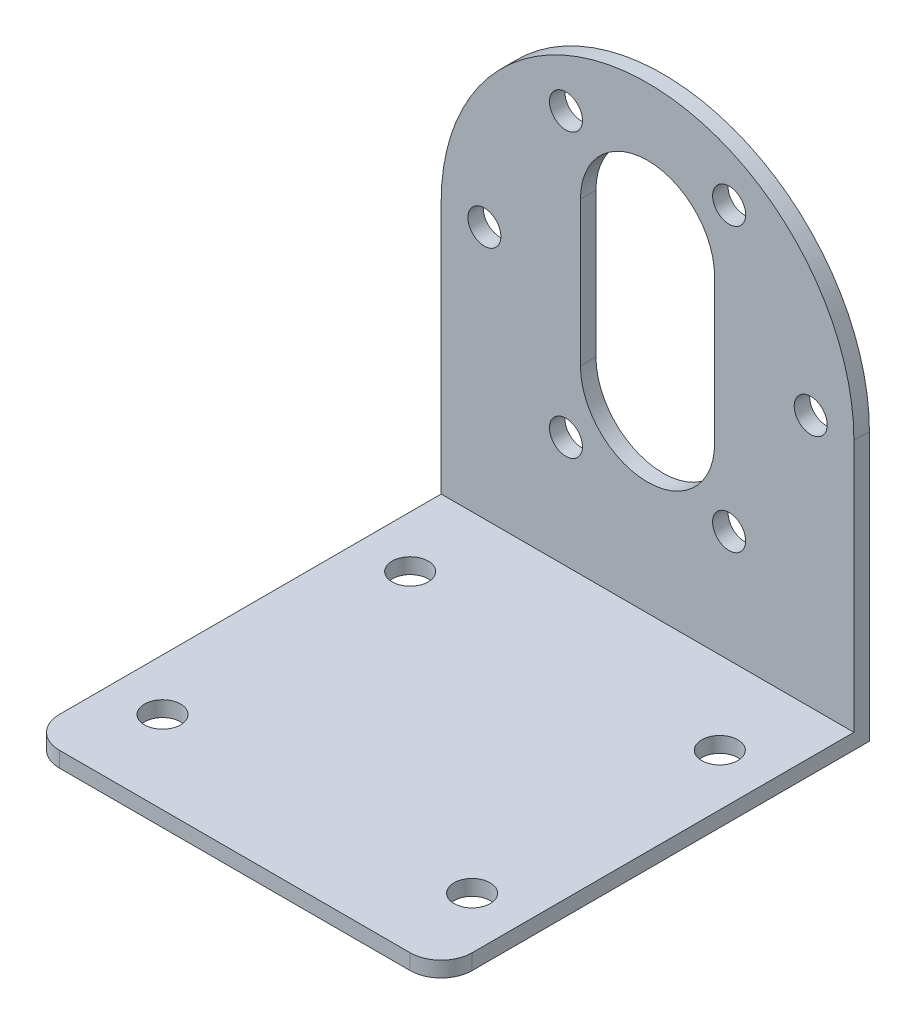
ISO-10303-21;
HEADER;
FILE_DESCRIPTION(('STEP AP214'),'2;1');
FILE_NAME('part.step','',(''),(''),'','','');
FILE_SCHEMA(('AUTOMOTIVE_DESIGN { 1 0 10303 214 1 1 1 1 }'));
ENDSEC;
DATA;
#1=APPLICATION_CONTEXT('core data for automotive mechanical design processes');
#2=APPLICATION_PROTOCOL_DEFINITION('international standard','automotive_design',2000,#1);
#3=PRODUCT_CONTEXT('',#1,'mechanical');
#4=PRODUCT('Part','Part','',(#3));
#5=PRODUCT_RELATED_PRODUCT_CATEGORY('part','',(#4));
#6=PRODUCT_DEFINITION_FORMATION('','',#4);
#7=PRODUCT_DEFINITION_CONTEXT('part definition',#1,'design');
#8=PRODUCT_DEFINITION('design','',#6,#7);
#9=PRODUCT_DEFINITION_SHAPE('','',#8);
#10=(LENGTH_UNIT() NAMED_UNIT(*) SI_UNIT(.MILLI.,.METRE.));
#11=(NAMED_UNIT(*) PLANE_ANGLE_UNIT() SI_UNIT($,.RADIAN.));
#12=(NAMED_UNIT(*) SI_UNIT($,.STERADIAN.) SOLID_ANGLE_UNIT());
#13=UNCERTAINTY_MEASURE_WITH_UNIT(LENGTH_MEASURE(1.E-05),#10,'distance_accuracy_value','');
#14=(GEOMETRIC_REPRESENTATION_CONTEXT(3) GLOBAL_UNCERTAINTY_ASSIGNED_CONTEXT((#13)) GLOBAL_UNIT_ASSIGNED_CONTEXT((#10,
#11,#12)) REPRESENTATION_CONTEXT('',''));
#15=CARTESIAN_POINT('',(0.,0.,0.));
#16=DIRECTION('',(0.,0.,1.));
#17=DIRECTION('',(1.,0.,0.));
#18=AXIS2_PLACEMENT_3D('',#15,#16,#17);
#19=CARTESIAN_POINT('',(0.,1.5,0.));
#20=DIRECTION('',(0.,1.,0.));
#21=DIRECTION('',(0.,0.,1.));
#22=AXIS2_PLACEMENT_3D('',#19,#20,#21);
#23=PLANE('',#22);
#24=CARTESIAN_POINT('',(14.9999999999999,1.5,-12.));
#25=DIRECTION('',(0.,1.,0.));
#26=DIRECTION('',(0.,0.,1.));
#27=AXIS2_PLACEMENT_3D('',#24,#25,#26);
#28=CIRCLE('',#27,1.75);
#29=CARTESIAN_POINT('',(14.9999999999999,1.5,-10.25));
#30=VERTEX_POINT('',#29);
#31=EDGE_CURVE('E207',#30,#30,#28,.T.);
#32=ORIENTED_EDGE('',*,*,#31,.F.);
#33=EDGE_LOOP('',(#32));
#34=FACE_BOUND('',#33,.T.);
#35=CARTESIAN_POINT('',(-15.,1.5,12.));
#36=DIRECTION('',(0.,1.,0.));
#37=DIRECTION('',(0.,0.,1.));
#38=AXIS2_PLACEMENT_3D('',#35,#36,#37);
#39=CIRCLE('',#38,1.75);
#40=CARTESIAN_POINT('',(-15.,1.5,13.75));
#41=VERTEX_POINT('',#40);
#42=EDGE_CURVE('E219',#41,#41,#39,.T.);
#43=ORIENTED_EDGE('',*,*,#42,.F.);
#44=EDGE_LOOP('',(#43));
#45=FACE_BOUND('',#44,.T.);
#46=DIRECTION('',(1.,0.,0.));
#47=VECTOR('',#46,1.);
#48=CARTESIAN_POINT('',(-20.,1.5,20.));
#49=LINE('',#48,#47);
#50=CARTESIAN_POINT('',(-17.,1.5,20.));
#51=VERTEX_POINT('',#50);
#52=CARTESIAN_POINT('',(17.,1.5,20.));
#53=VERTEX_POINT('',#52);
#54=EDGE_CURVE('E227',#51,#53,#49,.T.);
#55=ORIENTED_EDGE('',*,*,#54,.T.);
#56=CARTESIAN_POINT('',(17.,1.5,17.));
#57=DIRECTION('',(0.,1.,0.));
#58=DIRECTION('',(0.,0.,1.));
#59=AXIS2_PLACEMENT_3D('',#56,#57,#58);
#60=CIRCLE('',#59,3.);
#61=CARTESIAN_POINT('',(20.,1.5,17.));
#62=VERTEX_POINT('',#61);
#63=EDGE_CURVE('E49',#53,#62,#60,.T.);
#64=ORIENTED_EDGE('',*,*,#63,.T.);
#65=DIRECTION('',(0.,0.,-1.));
#66=VECTOR('',#65,1.);
#67=CARTESIAN_POINT('',(20.,1.5,-20.));
#68=LINE('',#67,#66);
#69=CARTESIAN_POINT('',(20.,1.5,-20.));
#70=VERTEX_POINT('',#69);
#71=EDGE_CURVE('E230',#62,#70,#68,.T.);
#72=ORIENTED_EDGE('',*,*,#71,.T.);
#73=DIRECTION('',(-1.,0.,0.));
#74=VECTOR('',#73,1.);
#75=CARTESIAN_POINT('',(-20.,1.5,-20.));
#76=LINE('',#75,#74);
#77=CARTESIAN_POINT('',(-20.,1.5,-20.));
#78=VERTEX_POINT('',#77);
#79=EDGE_CURVE('E233',#70,#78,#76,.T.);
#80=ORIENTED_EDGE('',*,*,#79,.T.);
#81=DIRECTION('',(0.,0.,1.));
#82=VECTOR('',#81,1.);
#83=CARTESIAN_POINT('',(-20.,1.5,-20.));
#84=LINE('',#83,#82);
#85=CARTESIAN_POINT('',(-20.,1.5,17.));
#86=VERTEX_POINT('',#85);
#87=EDGE_CURVE('E225',#78,#86,#84,.T.);
#88=ORIENTED_EDGE('',*,*,#87,.T.);
#89=CARTESIAN_POINT('',(-17.,1.5,17.));
#90=DIRECTION('',(0.,1.,0.));
#91=DIRECTION('',(0.,0.,1.));
#92=AXIS2_PLACEMENT_3D('',#89,#90,#91);
#93=CIRCLE('',#92,3.);
#94=EDGE_CURVE('E251',#86,#51,#93,.T.);
#95=ORIENTED_EDGE('',*,*,#94,.T.);
#96=EDGE_LOOP('',(#55,#64,#72,#80,#88,#95));
#97=FACE_BOUND('',#96,.T.);
#98=CARTESIAN_POINT('',(15.,1.5,12.));
#99=DIRECTION('',(0.,1.,0.));
#100=DIRECTION('',(0.,0.,1.));
#101=AXIS2_PLACEMENT_3D('',#98,#99,#100);
#102=CIRCLE('',#101,1.75);
#103=CARTESIAN_POINT('',(15.,1.5,13.75));
#104=VERTEX_POINT('',#103);
#105=EDGE_CURVE('E213',#104,#104,#102,.T.);
#106=ORIENTED_EDGE('',*,*,#105,.F.);
#107=EDGE_LOOP('',(#106));
#108=FACE_BOUND('',#107,.T.);
#109=CARTESIAN_POINT('',(-15.0000000000001,1.5,-12.));
#110=DIRECTION('',(0.,1.,0.));
#111=DIRECTION('',(0.,0.,1.));
#112=AXIS2_PLACEMENT_3D('',#109,#110,#111);
#113=CIRCLE('',#112,1.75);
#114=CARTESIAN_POINT('',(-15.0000000000001,1.5,-10.25));
#115=VERTEX_POINT('',#114);
#116=EDGE_CURVE('E201',#115,#115,#113,.T.);
#117=ORIENTED_EDGE('',*,*,#116,.F.);
#118=EDGE_LOOP('',(#117));
#119=FACE_BOUND('',#118,.T.);
#120=ADVANCED_FACE('F41',(#34,#45,#97,#108,#119),#23,.T.);
#121=CARTESIAN_POINT('',(0.,0.,0.));
#122=DIRECTION('',(0.,1.,0.));
#123=DIRECTION('',(0.,0.,1.));
#124=AXIS2_PLACEMENT_3D('',#121,#122,#123);
#125=PLANE('',#124);
#126=DIRECTION('',(0.,0.,-1.));
#127=VECTOR('',#126,1.);
#128=CARTESIAN_POINT('',(20.,0.,-20.));
#129=LINE('',#128,#127);
#130=CARTESIAN_POINT('',(20.,0.,17.));
#131=VERTEX_POINT('',#130);
#132=CARTESIAN_POINT('',(20.,0.,-21.5));
#133=VERTEX_POINT('',#132);
#134=EDGE_CURVE('E228',#131,#133,#129,.T.);
#135=ORIENTED_EDGE('',*,*,#134,.F.);
#136=CARTESIAN_POINT('',(17.,0.,17.));
#137=DIRECTION('',(0.,1.,0.));
#138=DIRECTION('',(0.,0.,1.));
#139=AXIS2_PLACEMENT_3D('',#136,#137,#138);
#140=CIRCLE('',#139,3.);
#141=CARTESIAN_POINT('',(17.,0.,20.));
#142=VERTEX_POINT('',#141);
#143=EDGE_CURVE('E245',#131,#142,#140,.F.);
#144=ORIENTED_EDGE('',*,*,#143,.T.);
#145=DIRECTION('',(1.,0.,0.));
#146=VECTOR('',#145,1.);
#147=CARTESIAN_POINT('',(-20.,0.,20.));
#148=LINE('',#147,#146);
#149=CARTESIAN_POINT('',(-17.,0.,20.));
#150=VERTEX_POINT('',#149);
#151=EDGE_CURVE('E238',#150,#142,#148,.T.);
#152=ORIENTED_EDGE('',*,*,#151,.F.);
#153=CARTESIAN_POINT('',(-17.,0.,17.));
#154=DIRECTION('',(0.,1.,0.));
#155=DIRECTION('',(0.,0.,1.));
#156=AXIS2_PLACEMENT_3D('',#153,#154,#155);
#157=CIRCLE('',#156,3.);
#158=CARTESIAN_POINT('',(-20.,0.,17.));
#159=VERTEX_POINT('',#158);
#160=EDGE_CURVE('E243',#150,#159,#157,.F.);
#161=ORIENTED_EDGE('',*,*,#160,.T.);
#162=DIRECTION('',(0.,0.,1.));
#163=VECTOR('',#162,1.);
#164=CARTESIAN_POINT('',(-20.,0.,-20.));
#165=LINE('',#164,#163);
#166=CARTESIAN_POINT('',(-20.,0.,-21.5));
#167=VERTEX_POINT('',#166);
#168=EDGE_CURVE('E222',#167,#159,#165,.T.);
#169=ORIENTED_EDGE('',*,*,#168,.F.);
#170=DIRECTION('',(-1.,0.,0.));
#171=VECTOR('',#170,1.);
#172=CARTESIAN_POINT('',(20.,0.,-21.5));
#173=LINE('',#172,#171);
#174=EDGE_CURVE('E181',#133,#167,#173,.T.);
#175=ORIENTED_EDGE('',*,*,#174,.F.);
#176=EDGE_LOOP('',(#135,#144,#152,#161,#169,#175));
#177=FACE_BOUND('',#176,.T.);
#178=CARTESIAN_POINT('',(-15.,0.,12.));
#179=DIRECTION('',(0.,1.,0.));
#180=DIRECTION('',(0.,0.,1.));
#181=AXIS2_PLACEMENT_3D('',#178,#179,#180);
#182=CIRCLE('',#181,1.75);
#183=CARTESIAN_POINT('',(-15.,0.,13.75));
#184=VERTEX_POINT('',#183);
#185=EDGE_CURVE('E216',#184,#184,#182,.T.);
#186=ORIENTED_EDGE('',*,*,#185,.T.);
#187=EDGE_LOOP('',(#186));
#188=FACE_BOUND('',#187,.T.);
#189=CARTESIAN_POINT('',(15.,0.,12.));
#190=DIRECTION('',(0.,1.,0.));
#191=DIRECTION('',(0.,0.,1.));
#192=AXIS2_PLACEMENT_3D('',#189,#190,#191);
#193=CIRCLE('',#192,1.75);
#194=CARTESIAN_POINT('',(15.,0.,13.75));
#195=VERTEX_POINT('',#194);
#196=EDGE_CURVE('E210',#195,#195,#193,.T.);
#197=ORIENTED_EDGE('',*,*,#196,.T.);
#198=EDGE_LOOP('',(#197));
#199=FACE_BOUND('',#198,.T.);
#200=CARTESIAN_POINT('',(14.9999999999999,0.,-12.));
#201=DIRECTION('',(0.,1.,0.));
#202=DIRECTION('',(0.,0.,1.));
#203=AXIS2_PLACEMENT_3D('',#200,#201,#202);
#204=CIRCLE('',#203,1.75);
#205=CARTESIAN_POINT('',(14.9999999999999,0.,-10.25));
#206=VERTEX_POINT('',#205);
#207=EDGE_CURVE('E204',#206,#206,#204,.T.);
#208=ORIENTED_EDGE('',*,*,#207,.T.);
#209=EDGE_LOOP('',(#208));
#210=FACE_BOUND('',#209,.T.);
#211=CARTESIAN_POINT('',(-15.0000000000001,0.,-12.));
#212=DIRECTION('',(0.,1.,0.));
#213=DIRECTION('',(0.,0.,1.));
#214=AXIS2_PLACEMENT_3D('',#211,#212,#213);
#215=CIRCLE('',#214,1.75);
#216=CARTESIAN_POINT('',(-15.0000000000001,0.,-10.25));
#217=VERTEX_POINT('',#216);
#218=EDGE_CURVE('E200',#217,#217,#215,.T.);
#219=ORIENTED_EDGE('',*,*,#218,.T.);
#220=EDGE_LOOP('',(#219));
#221=FACE_BOUND('',#220,.T.);
#222=ADVANCED_FACE('F265',(#177,#188,#199,#210,#221),#125,.F.);
#223=CARTESIAN_POINT('',(-20.,1.5,-20.));
#224=DIRECTION('',(1.,0.,0.));
#225=DIRECTION('',(0.,0.,-1.));
#226=AXIS2_PLACEMENT_3D('',#223,#224,#225);
#227=PLANE('',#226);
#228=ORIENTED_EDGE('',*,*,#168,.T.);
#229=DIRECTION('',(0.,-1.,0.));
#230=VECTOR('',#229,1.);
#231=CARTESIAN_POINT('',(-20.,1.5,17.));
#232=LINE('',#231,#230);
#233=EDGE_CURVE('E11',#159,#86,#232,.F.);
#234=ORIENTED_EDGE('',*,*,#233,.T.);
#235=ORIENTED_EDGE('',*,*,#87,.F.);
#236=DIRECTION('',(0.,1.,0.));
#237=VECTOR('',#236,1.);
#238=CARTESIAN_POINT('',(-20.,0.,-20.));
#239=LINE('',#238,#237);
#240=CARTESIAN_POINT('',(-20.,26.,-20.));
#241=VERTEX_POINT('',#240);
#242=EDGE_CURVE('E192',#78,#241,#239,.T.);
#243=ORIENTED_EDGE('',*,*,#242,.T.);
#244=DIRECTION('',(0.,0.,1.));
#245=VECTOR('',#244,1.);
#246=CARTESIAN_POINT('',(-20.,26.,-21.5));
#247=LINE('',#246,#245);
#248=CARTESIAN_POINT('',(-20.,26.,-21.5));
#249=VERTEX_POINT('',#248);
#250=EDGE_CURVE('E197',#249,#241,#247,.T.);
#251=ORIENTED_EDGE('',*,*,#250,.F.);
#252=DIRECTION('',(0.,1.,0.));
#253=VECTOR('',#252,1.);
#254=CARTESIAN_POINT('',(-20.,0.,-21.5));
#255=LINE('',#254,#253);
#256=EDGE_CURVE('E185',#167,#249,#255,.T.);
#257=ORIENTED_EDGE('',*,*,#256,.F.);
#258=EDGE_LOOP('',(#228,#234,#235,#243,#251,#257));
#259=FACE_BOUND('',#258,.T.);
#260=ADVANCED_FACE('F273',(#259),#227,.F.);
#261=CARTESIAN_POINT('',(-20.,1.5,20.));
#262=DIRECTION('',(0.,0.,-1.));
#263=DIRECTION('',(-1.,0.,0.));
#264=AXIS2_PLACEMENT_3D('',#261,#262,#263);
#265=PLANE('',#264);
#266=ORIENTED_EDGE('',*,*,#151,.T.);
#267=DIRECTION('',(0.,-1.,0.));
#268=VECTOR('',#267,1.);
#269=CARTESIAN_POINT('',(17.,1.5,20.));
#270=LINE('',#269,#268);
#271=EDGE_CURVE('E62',#142,#53,#270,.F.);
#272=ORIENTED_EDGE('',*,*,#271,.T.);
#273=ORIENTED_EDGE('',*,*,#54,.F.);
#274=DIRECTION('',(0.,-1.,0.));
#275=VECTOR('',#274,1.);
#276=CARTESIAN_POINT('',(-17.,1.5,20.));
#277=LINE('',#276,#275);
#278=EDGE_CURVE('E247',#51,#150,#277,.T.);
#279=ORIENTED_EDGE('',*,*,#278,.T.);
#280=EDGE_LOOP('',(#266,#272,#273,#279));
#281=FACE_BOUND('',#280,.T.);
#282=ADVANCED_FACE('F268',(#281),#265,.F.);
#283=CARTESIAN_POINT('',(20.,1.5,-20.));
#284=DIRECTION('',(-1.,0.,0.));
#285=DIRECTION('',(0.,0.,1.));
#286=AXIS2_PLACEMENT_3D('',#283,#284,#285);
#287=PLANE('',#286);
#288=ORIENTED_EDGE('',*,*,#71,.F.);
#289=DIRECTION('',(0.,-1.,0.));
#290=VECTOR('',#289,1.);
#291=CARTESIAN_POINT('',(20.,1.5,17.));
#292=LINE('',#291,#290);
#293=EDGE_CURVE('E236',#62,#131,#292,.T.);
#294=ORIENTED_EDGE('',*,*,#293,.T.);
#295=ORIENTED_EDGE('',*,*,#134,.T.);
#296=DIRECTION('',(0.,-1.,0.));
#297=VECTOR('',#296,1.);
#298=CARTESIAN_POINT('',(20.,0.,-21.5));
#299=LINE('',#298,#297);
#300=CARTESIAN_POINT('',(20.,26.,-21.5));
#301=VERTEX_POINT('',#300);
#302=EDGE_CURVE('E178',#301,#133,#299,.T.);
#303=ORIENTED_EDGE('',*,*,#302,.F.);
#304=DIRECTION('',(0.,0.,1.));
#305=VECTOR('',#304,1.);
#306=CARTESIAN_POINT('',(20.,26.,-21.5));
#307=LINE('',#306,#305);
#308=CARTESIAN_POINT('',(20.,26.,-20.));
#309=VERTEX_POINT('',#308);
#310=EDGE_CURVE('E189',#301,#309,#307,.T.);
#311=ORIENTED_EDGE('',*,*,#310,.T.);
#312=DIRECTION('',(0.,-1.,0.));
#313=VECTOR('',#312,1.);
#314=CARTESIAN_POINT('',(20.,0.,-20.));
#315=LINE('',#314,#313);
#316=EDGE_CURVE('E151',#309,#70,#315,.T.);
#317=ORIENTED_EDGE('',*,*,#316,.T.);
#318=EDGE_LOOP('',(#288,#294,#295,#303,#311,#317));
#319=FACE_BOUND('',#318,.T.);
#320=ADVANCED_FACE('F259',(#319),#287,.F.);
#321=CARTESIAN_POINT('',(-15.,1.5,12.));
#322=DIRECTION('',(0.,-1.,0.));
#323=DIRECTION('',(0.,0.,-1.));
#324=AXIS2_PLACEMENT_3D('',#321,#322,#323);
#325=CYLINDRICAL_SURFACE('',#324,1.75);
#326=ORIENTED_EDGE('',*,*,#42,.T.);
#327=EDGE_LOOP('',(#326));
#328=FACE_BOUND('',#327,.T.);
#329=ORIENTED_EDGE('',*,*,#185,.F.);
#330=EDGE_LOOP('',(#329));
#331=FACE_BOUND('',#330,.T.);
#332=ADVANCED_FACE('F304',(#328,#331),#325,.F.);
#333=CARTESIAN_POINT('',(15.,1.5,12.));
#334=DIRECTION('',(0.,-1.,0.));
#335=DIRECTION('',(0.,0.,-1.));
#336=AXIS2_PLACEMENT_3D('',#333,#334,#335);
#337=CYLINDRICAL_SURFACE('',#336,1.75);
#338=ORIENTED_EDGE('',*,*,#105,.T.);
#339=EDGE_LOOP('',(#338));
#340=FACE_BOUND('',#339,.T.);
#341=ORIENTED_EDGE('',*,*,#196,.F.);
#342=EDGE_LOOP('',(#341));
#343=FACE_BOUND('',#342,.T.);
#344=ADVANCED_FACE('F323',(#340,#343),#337,.F.);
#345=CARTESIAN_POINT('',(14.9999999999999,1.5,-12.));
#346=DIRECTION('',(0.,-1.,0.));
#347=DIRECTION('',(0.,0.,-1.));
#348=AXIS2_PLACEMENT_3D('',#345,#346,#347);
#349=CYLINDRICAL_SURFACE('',#348,1.75);
#350=ORIENTED_EDGE('',*,*,#31,.T.);
#351=EDGE_LOOP('',(#350));
#352=FACE_BOUND('',#351,.T.);
#353=ORIENTED_EDGE('',*,*,#207,.F.);
#354=EDGE_LOOP('',(#353));
#355=FACE_BOUND('',#354,.T.);
#356=ADVANCED_FACE('F318',(#352,#355),#349,.F.);
#357=CARTESIAN_POINT('',(-15.0000000000001,1.5,-12.));
#358=DIRECTION('',(0.,-1.,0.));
#359=DIRECTION('',(0.,0.,-1.));
#360=AXIS2_PLACEMENT_3D('',#357,#358,#359);
#361=CYLINDRICAL_SURFACE('',#360,1.75);
#362=ORIENTED_EDGE('',*,*,#116,.T.);
#363=EDGE_LOOP('',(#362));
#364=FACE_BOUND('',#363,.T.);
#365=ORIENTED_EDGE('',*,*,#218,.F.);
#366=EDGE_LOOP('',(#365));
#367=FACE_BOUND('',#366,.T.);
#368=ADVANCED_FACE('F313',(#364,#367),#361,.F.);
#369=CARTESIAN_POINT('',(17.,1.5,17.));
#370=DIRECTION('',(0.,-1.,0.));
#371=DIRECTION('',(0.,0.,-1.));
#372=AXIS2_PLACEMENT_3D('',#369,#370,#371);
#373=CYLINDRICAL_SURFACE('',#372,3.);
#374=ORIENTED_EDGE('',*,*,#63,.F.);
#375=ORIENTED_EDGE('',*,*,#271,.F.);
#376=ORIENTED_EDGE('',*,*,#143,.F.);
#377=ORIENTED_EDGE('',*,*,#293,.F.);
#378=EDGE_LOOP('',(#374,#375,#376,#377));
#379=FACE_BOUND('',#378,.T.);
#380=ADVANCED_FACE('F262',(#379),#373,.T.);
#381=CARTESIAN_POINT('',(-17.,1.5,17.));
#382=DIRECTION('',(0.,-1.,0.));
#383=DIRECTION('',(0.,0.,-1.));
#384=AXIS2_PLACEMENT_3D('',#381,#382,#383);
#385=CYLINDRICAL_SURFACE('',#384,3.);
#386=ORIENTED_EDGE('',*,*,#94,.F.);
#387=ORIENTED_EDGE('',*,*,#233,.F.);
#388=ORIENTED_EDGE('',*,*,#160,.F.);
#389=ORIENTED_EDGE('',*,*,#278,.F.);
#390=EDGE_LOOP('',(#386,#387,#388,#389));
#391=FACE_BOUND('',#390,.T.);
#392=ADVANCED_FACE('F43',(#391),#385,.T.);
#393=CARTESIAN_POINT('',(0.,26.,-21.5));
#394=DIRECTION('',(0.,0.,-1.));
#395=DIRECTION('',(-1.,0.,0.));
#396=AXIS2_PLACEMENT_3D('',#393,#394,#395);
#397=PLANE('',#396);
#398=CARTESIAN_POINT('',(7.90585582992862,39.6933439747513,-21.5));
#399=DIRECTION('',(0.,0.,-1.));
#400=DIRECTION('',(-1.,0.,0.));
#401=AXIS2_PLACEMENT_3D('',#398,#399,#400);
#402=CIRCLE('',#401,1.6);
#403=CARTESIAN_POINT('',(6.30585582992862,39.6933439747513,-21.5));
#404=VERTEX_POINT('',#403);
#405=EDGE_CURVE('E536',#404,#404,#402,.T.);
#406=ORIENTED_EDGE('',*,*,#405,.F.);
#407=EDGE_LOOP('',(#406));
#408=FACE_BOUND('',#407,.T.);
#409=CARTESIAN_POINT('',(7.90585582992881,12.3066560252488,-21.5));
#410=DIRECTION('',(0.,0.,-1.));
#411=DIRECTION('',(-1.,0.,0.));
#412=AXIS2_PLACEMENT_3D('',#409,#410,#411);
#413=CIRCLE('',#412,1.6);
#414=CARTESIAN_POINT('',(6.30585582992881,12.3066560252488,-21.5));
#415=VERTEX_POINT('',#414);
#416=EDGE_CURVE('E548',#415,#415,#413,.T.);
#417=ORIENTED_EDGE('',*,*,#416,.F.);
#418=EDGE_LOOP('',(#417));
#419=FACE_BOUND('',#418,.T.);
#420=CARTESIAN_POINT('',(-15.8117116598575,26.,-21.5));
#421=DIRECTION('',(0.,0.,-1.));
#422=DIRECTION('',(-1.,0.,0.));
#423=AXIS2_PLACEMENT_3D('',#420,#421,#422);
#424=CIRCLE('',#423,1.6);
#425=CARTESIAN_POINT('',(-17.4117116598575,26.,-21.5));
#426=VERTEX_POINT('',#425);
#427=EDGE_CURVE('E167',#426,#426,#424,.T.);
#428=ORIENTED_EDGE('',*,*,#427,.F.);
#429=EDGE_LOOP('',(#428));
#430=FACE_BOUND('',#429,.T.);
#431=ORIENTED_EDGE('',*,*,#302,.T.);
#432=ORIENTED_EDGE('',*,*,#174,.T.);
#433=ORIENTED_EDGE('',*,*,#256,.T.);
#434=CARTESIAN_POINT('',(0.,26.,-21.5));
#435=DIRECTION('',(0.,0.,-1.));
#436=DIRECTION('',(-1.,0.,0.));
#437=AXIS2_PLACEMENT_3D('',#434,#435,#436);
#438=CIRCLE('',#437,20.);
#439=EDGE_CURVE('E187',#249,#301,#438,.T.);
#440=ORIENTED_EDGE('',*,*,#439,.T.);
#441=EDGE_LOOP('',(#431,#432,#433,#440));
#442=FACE_BOUND('',#441,.T.);
#443=DIRECTION('',(0.,-1.,0.));
#444=VECTOR('',#443,1.);
#445=CARTESIAN_POINT('',(6.5,33.,-21.5));
#446=LINE('',#445,#444);
#447=CARTESIAN_POINT('',(6.5,33.,-21.5));
#448=VERTEX_POINT('',#447);
#449=CARTESIAN_POINT('',(6.5,19.,-21.5));
#450=VERTEX_POINT('',#449);
#451=EDGE_CURVE('E143',#448,#450,#446,.T.);
#452=ORIENTED_EDGE('',*,*,#451,.F.);
#453=CARTESIAN_POINT('',(0.,33.,-21.5));
#454=DIRECTION('',(0.,0.,-1.));
#455=DIRECTION('',(-1.,0.,0.));
#456=AXIS2_PLACEMENT_3D('',#453,#454,#455);
#457=CIRCLE('',#456,6.5);
#458=CARTESIAN_POINT('',(-6.5,33.,-21.5));
#459=VERTEX_POINT('',#458);
#460=EDGE_CURVE('E133',#459,#448,#457,.T.);
#461=ORIENTED_EDGE('',*,*,#460,.F.);
#462=DIRECTION('',(0.,1.,0.));
#463=VECTOR('',#462,1.);
#464=CARTESIAN_POINT('',(-6.5,33.,-21.5));
#465=LINE('',#464,#463);
#466=CARTESIAN_POINT('',(-6.5,19.,-21.5));
#467=VERTEX_POINT('',#466);
#468=EDGE_CURVE('E160',#467,#459,#465,.T.);
#469=ORIENTED_EDGE('',*,*,#468,.F.);
#470=CARTESIAN_POINT('',(0.,19.,-21.5));
#471=DIRECTION('',(0.,0.,-1.));
#472=DIRECTION('',(-1.,0.,0.));
#473=AXIS2_PLACEMENT_3D('',#470,#471,#472);
#474=CIRCLE('',#473,6.5);
#475=EDGE_CURVE('E158',#450,#467,#474,.T.);
#476=ORIENTED_EDGE('',*,*,#475,.F.);
#477=EDGE_LOOP('',(#452,#461,#469,#476));
#478=FACE_BOUND('',#477,.T.);
#479=CARTESIAN_POINT('',(-7.90585582992876,12.306656025249,-21.5));
#480=DIRECTION('',(0.,0.,-1.));
#481=DIRECTION('',(-1.,0.,0.));
#482=AXIS2_PLACEMENT_3D('',#479,#480,#481);
#483=CIRCLE('',#482,1.60000000000012);
#484=CARTESIAN_POINT('',(-9.50585582992887,12.306656025249,-21.5));
#485=VERTEX_POINT('',#484);
#486=EDGE_CURVE('E554',#485,#485,#483,.T.);
#487=ORIENTED_EDGE('',*,*,#486,.F.);
#488=EDGE_LOOP('',(#487));
#489=FACE_BOUND('',#488,.T.);
#490=CARTESIAN_POINT('',(15.8117116598575,26.0000000000001,-21.5));
#491=DIRECTION('',(0.,0.,-1.));
#492=DIRECTION('',(-1.,0.,0.));
#493=AXIS2_PLACEMENT_3D('',#490,#491,#492);
#494=CIRCLE('',#493,1.6);
#495=CARTESIAN_POINT('',(14.2117116598575,26.0000000000001,-21.5));
#496=VERTEX_POINT('',#495);
#497=EDGE_CURVE('E542',#496,#496,#494,.T.);
#498=ORIENTED_EDGE('',*,*,#497,.F.);
#499=EDGE_LOOP('',(#498));
#500=FACE_BOUND('',#499,.T.);
#501=CARTESIAN_POINT('',(-7.90585582992892,39.6933439747511,-21.5));
#502=DIRECTION('',(0.,0.,-1.));
#503=DIRECTION('',(-1.,0.,0.));
#504=AXIS2_PLACEMENT_3D('',#501,#502,#503);
#505=CIRCLE('',#504,1.6);
#506=CARTESIAN_POINT('',(-9.50585582992892,39.6933439747511,-21.5));
#507=VERTEX_POINT('',#506);
#508=EDGE_CURVE('E527',#507,#507,#505,.T.);
#509=ORIENTED_EDGE('',*,*,#508,.F.);
#510=EDGE_LOOP('',(#509));
#511=FACE_BOUND('',#510,.T.);
#512=ADVANCED_FACE('F155',(#408,#419,#430,#442,#478,#489,#500,#511),#397,.T.);
#513=CARTESIAN_POINT('',(0.,26.,-20.));
#514=DIRECTION('',(0.,0.,-1.));
#515=DIRECTION('',(-1.,0.,0.));
#516=AXIS2_PLACEMENT_3D('',#513,#514,#515);
#517=PLANE('',#516);
#518=ORIENTED_EDGE('',*,*,#79,.F.);
#519=ORIENTED_EDGE('',*,*,#316,.F.);
#520=CARTESIAN_POINT('',(0.,26.,-20.));
#521=DIRECTION('',(0.,0.,-1.));
#522=DIRECTION('',(-1.,0.,0.));
#523=AXIS2_PLACEMENT_3D('',#520,#521,#522);
#524=CIRCLE('',#523,20.);
#525=EDGE_CURVE('E182',#241,#309,#524,.T.);
#526=ORIENTED_EDGE('',*,*,#525,.F.);
#527=ORIENTED_EDGE('',*,*,#242,.F.);
#528=EDGE_LOOP('',(#518,#519,#526,#527));
#529=FACE_BOUND('',#528,.T.);
#530=CARTESIAN_POINT('',(0.,33.,-20.));
#531=DIRECTION('',(0.,0.,-1.));
#532=DIRECTION('',(-1.,0.,0.));
#533=AXIS2_PLACEMENT_3D('',#530,#531,#532);
#534=CIRCLE('',#533,6.5);
#535=CARTESIAN_POINT('',(-6.5,33.,-20.));
#536=VERTEX_POINT('',#535);
#537=CARTESIAN_POINT('',(6.5,33.,-20.));
#538=VERTEX_POINT('',#537);
#539=EDGE_CURVE('E165',#536,#538,#534,.T.);
#540=ORIENTED_EDGE('',*,*,#539,.T.);
#541=DIRECTION('',(0.,-1.,0.));
#542=VECTOR('',#541,1.);
#543=CARTESIAN_POINT('',(6.5,33.,-20.));
#544=LINE('',#543,#542);
#545=CARTESIAN_POINT('',(6.5,19.,-20.));
#546=VERTEX_POINT('',#545);
#547=EDGE_CURVE('E150',#538,#546,#544,.T.);
#548=ORIENTED_EDGE('',*,*,#547,.T.);
#549=CARTESIAN_POINT('',(0.,19.,-20.));
#550=DIRECTION('',(0.,0.,-1.));
#551=DIRECTION('',(-1.,0.,0.));
#552=AXIS2_PLACEMENT_3D('',#549,#550,#551);
#553=CIRCLE('',#552,6.5);
#554=CARTESIAN_POINT('',(-6.5,19.,-20.));
#555=VERTEX_POINT('',#554);
#556=EDGE_CURVE('E169',#546,#555,#553,.T.);
#557=ORIENTED_EDGE('',*,*,#556,.T.);
#558=DIRECTION('',(0.,1.,0.));
#559=VECTOR('',#558,1.);
#560=CARTESIAN_POINT('',(-6.5,33.,-20.));
#561=LINE('',#560,#559);
#562=EDGE_CURVE('E144',#555,#536,#561,.T.);
#563=ORIENTED_EDGE('',*,*,#562,.T.);
#564=EDGE_LOOP('',(#540,#548,#557,#563));
#565=FACE_BOUND('',#564,.T.);
#566=CARTESIAN_POINT('',(-15.8117116598575,26.,-20.));
#567=DIRECTION('',(0.,0.,-1.));
#568=DIRECTION('',(-1.,0.,0.));
#569=AXIS2_PLACEMENT_3D('',#566,#567,#568);
#570=CIRCLE('',#569,1.6);
#571=CARTESIAN_POINT('',(-17.4117116598575,26.,-20.));
#572=VERTEX_POINT('',#571);
#573=EDGE_CURVE('E557',#572,#572,#570,.T.);
#574=ORIENTED_EDGE('',*,*,#573,.T.);
#575=EDGE_LOOP('',(#574));
#576=FACE_BOUND('',#575,.T.);
#577=CARTESIAN_POINT('',(-7.90585582992876,12.306656025249,-20.));
#578=DIRECTION('',(0.,0.,-1.));
#579=DIRECTION('',(-1.,0.,0.));
#580=AXIS2_PLACEMENT_3D('',#577,#578,#579);
#581=CIRCLE('',#580,1.60000000000012);
#582=CARTESIAN_POINT('',(-9.50585582992887,12.306656025249,-20.));
#583=VERTEX_POINT('',#582);
#584=EDGE_CURVE('E551',#583,#583,#581,.T.);
#585=ORIENTED_EDGE('',*,*,#584,.T.);
#586=EDGE_LOOP('',(#585));
#587=FACE_BOUND('',#586,.T.);
#588=CARTESIAN_POINT('',(7.90585582992881,12.3066560252488,-20.));
#589=DIRECTION('',(0.,0.,-1.));
#590=DIRECTION('',(-1.,0.,0.));
#591=AXIS2_PLACEMENT_3D('',#588,#589,#590);
#592=CIRCLE('',#591,1.6);
#593=CARTESIAN_POINT('',(6.30585582992881,12.3066560252488,-20.));
#594=VERTEX_POINT('',#593);
#595=EDGE_CURVE('E545',#594,#594,#592,.T.);
#596=ORIENTED_EDGE('',*,*,#595,.T.);
#597=EDGE_LOOP('',(#596));
#598=FACE_BOUND('',#597,.T.);
#599=CARTESIAN_POINT('',(15.8117116598575,26.0000000000001,-20.));
#600=DIRECTION('',(0.,0.,-1.));
#601=DIRECTION('',(-1.,0.,0.));
#602=AXIS2_PLACEMENT_3D('',#599,#600,#601);
#603=CIRCLE('',#602,1.6);
#604=CARTESIAN_POINT('',(14.2117116598575,26.0000000000001,-20.));
#605=VERTEX_POINT('',#604);
#606=EDGE_CURVE('E539',#605,#605,#603,.T.);
#607=ORIENTED_EDGE('',*,*,#606,.T.);
#608=EDGE_LOOP('',(#607));
#609=FACE_BOUND('',#608,.T.);
#610=CARTESIAN_POINT('',(7.90585582992862,39.6933439747513,-20.));
#611=DIRECTION('',(0.,0.,-1.));
#612=DIRECTION('',(-1.,0.,0.));
#613=AXIS2_PLACEMENT_3D('',#610,#611,#612);
#614=CIRCLE('',#613,1.6);
#615=CARTESIAN_POINT('',(6.30585582992862,39.6933439747513,-20.));
#616=VERTEX_POINT('',#615);
#617=EDGE_CURVE('E533',#616,#616,#614,.T.);
#618=ORIENTED_EDGE('',*,*,#617,.T.);
#619=EDGE_LOOP('',(#618));
#620=FACE_BOUND('',#619,.T.);
#621=CARTESIAN_POINT('',(-7.90585582992892,39.6933439747511,-20.));
#622=DIRECTION('',(0.,0.,-1.));
#623=DIRECTION('',(-1.,0.,0.));
#624=AXIS2_PLACEMENT_3D('',#621,#622,#623);
#625=CIRCLE('',#624,1.6);
#626=CARTESIAN_POINT('',(-9.50585582992892,39.6933439747511,-20.));
#627=VERTEX_POINT('',#626);
#628=EDGE_CURVE('E530',#627,#627,#625,.T.);
#629=ORIENTED_EDGE('',*,*,#628,.T.);
#630=EDGE_LOOP('',(#629));
#631=FACE_BOUND('',#630,.T.);
#632=ADVANCED_FACE('F282',(#529,#565,#576,#587,#598,#609,#620,#631),#517,.F.);
#633=CARTESIAN_POINT('',(0.,26.,-21.5));
#634=DIRECTION('',(0.,0.,1.));
#635=DIRECTION('',(1.,0.,0.));
#636=AXIS2_PLACEMENT_3D('',#633,#634,#635);
#637=CYLINDRICAL_SURFACE('',#636,20.);
#638=ORIENTED_EDGE('',*,*,#525,.T.);
#639=ORIENTED_EDGE('',*,*,#310,.F.);
#640=ORIENTED_EDGE('',*,*,#439,.F.);
#641=ORIENTED_EDGE('',*,*,#250,.T.);
#642=EDGE_LOOP('',(#638,#639,#640,#641));
#643=FACE_BOUND('',#642,.T.);
#644=ADVANCED_FACE('F284',(#643),#637,.T.);
#645=CARTESIAN_POINT('',(0.,33.,-21.5));
#646=DIRECTION('',(0.,0.,1.));
#647=DIRECTION('',(1.,0.,0.));
#648=AXIS2_PLACEMENT_3D('',#645,#646,#647);
#649=CYLINDRICAL_SURFACE('',#648,6.5);
#650=ORIENTED_EDGE('',*,*,#539,.F.);
#651=DIRECTION('',(0.,0.,1.));
#652=VECTOR('',#651,1.);
#653=CARTESIAN_POINT('',(-6.5,33.,-21.5));
#654=LINE('',#653,#652);
#655=EDGE_CURVE('E139',#459,#536,#654,.T.);
#656=ORIENTED_EDGE('',*,*,#655,.F.);
#657=ORIENTED_EDGE('',*,*,#460,.T.);
#658=DIRECTION('',(0.,0.,1.));
#659=VECTOR('',#658,1.);
#660=CARTESIAN_POINT('',(6.5,33.,-21.5));
#661=LINE('',#660,#659);
#662=EDGE_CURVE('E136',#448,#538,#661,.T.);
#663=ORIENTED_EDGE('',*,*,#662,.T.);
#664=EDGE_LOOP('',(#650,#656,#657,#663));
#665=FACE_BOUND('',#664,.T.);
#666=ADVANCED_FACE('F135',(#665),#649,.F.);
#667=CARTESIAN_POINT('',(6.5,33.,-21.5));
#668=DIRECTION('',(-1.,0.,0.));
#669=DIRECTION('',(0.,-1.,0.));
#670=AXIS2_PLACEMENT_3D('',#667,#668,#669);
#671=PLANE('',#670);
#672=ORIENTED_EDGE('',*,*,#547,.F.);
#673=ORIENTED_EDGE('',*,*,#662,.F.);
#674=ORIENTED_EDGE('',*,*,#451,.T.);
#675=DIRECTION('',(0.,0.,1.));
#676=VECTOR('',#675,1.);
#677=CARTESIAN_POINT('',(6.5,19.,-21.5));
#678=LINE('',#677,#676);
#679=EDGE_CURVE('E152',#450,#546,#678,.T.);
#680=ORIENTED_EDGE('',*,*,#679,.T.);
#681=EDGE_LOOP('',(#672,#673,#674,#680));
#682=FACE_BOUND('',#681,.T.);
#683=ADVANCED_FACE('F147',(#682),#671,.T.);
#684=CARTESIAN_POINT('',(0.,19.,-21.5));
#685=DIRECTION('',(0.,0.,1.));
#686=DIRECTION('',(1.,0.,0.));
#687=AXIS2_PLACEMENT_3D('',#684,#685,#686);
#688=CYLINDRICAL_SURFACE('',#687,6.5);
#689=ORIENTED_EDGE('',*,*,#556,.F.);
#690=ORIENTED_EDGE('',*,*,#679,.F.);
#691=ORIENTED_EDGE('',*,*,#475,.T.);
#692=DIRECTION('',(0.,0.,1.));
#693=VECTOR('',#692,1.);
#694=CARTESIAN_POINT('',(-6.5,19.,-21.5));
#695=LINE('',#694,#693);
#696=EDGE_CURVE('E175',#467,#555,#695,.T.);
#697=ORIENTED_EDGE('',*,*,#696,.T.);
#698=EDGE_LOOP('',(#689,#690,#691,#697));
#699=FACE_BOUND('',#698,.T.);
#700=ADVANCED_FACE('F441',(#699),#688,.F.);
#701=CARTESIAN_POINT('',(-6.5,33.,-21.5));
#702=DIRECTION('',(1.,0.,0.));
#703=DIRECTION('',(0.,1.,0.));
#704=AXIS2_PLACEMENT_3D('',#701,#702,#703);
#705=PLANE('',#704);
#706=ORIENTED_EDGE('',*,*,#562,.F.);
#707=ORIENTED_EDGE('',*,*,#696,.F.);
#708=ORIENTED_EDGE('',*,*,#468,.T.);
#709=ORIENTED_EDGE('',*,*,#655,.T.);
#710=EDGE_LOOP('',(#706,#707,#708,#709));
#711=FACE_BOUND('',#710,.T.);
#712=ADVANCED_FACE('F449',(#711),#705,.T.);
#713=CARTESIAN_POINT('',(-15.8117116598575,26.,-21.5));
#714=DIRECTION('',(0.,0.,1.));
#715=DIRECTION('',(1.,0.,0.));
#716=AXIS2_PLACEMENT_3D('',#713,#714,#715);
#717=CYLINDRICAL_SURFACE('',#716,1.6);
#718=ORIENTED_EDGE('',*,*,#427,.T.);
#719=EDGE_LOOP('',(#718));
#720=FACE_BOUND('',#719,.T.);
#721=ORIENTED_EDGE('',*,*,#573,.F.);
#722=EDGE_LOOP('',(#721));
#723=FACE_BOUND('',#722,.T.);
#724=ADVANCED_FACE('F458',(#720,#723),#717,.F.);
#725=CARTESIAN_POINT('',(-7.90585582992876,12.306656025249,-21.5));
#726=DIRECTION('',(0.,0.,1.));
#727=DIRECTION('',(1.,0.,0.));
#728=AXIS2_PLACEMENT_3D('',#725,#726,#727);
#729=CYLINDRICAL_SURFACE('',#728,1.60000000000012);
#730=ORIENTED_EDGE('',*,*,#486,.T.);
#731=EDGE_LOOP('',(#730));
#732=FACE_BOUND('',#731,.T.);
#733=ORIENTED_EDGE('',*,*,#584,.F.);
#734=EDGE_LOOP('',(#733));
#735=FACE_BOUND('',#734,.T.);
#736=ADVANCED_FACE('F467',(#732,#735),#729,.F.);
#737=CARTESIAN_POINT('',(7.90585582992881,12.3066560252488,-21.5));
#738=DIRECTION('',(0.,0.,1.));
#739=DIRECTION('',(1.,0.,0.));
#740=AXIS2_PLACEMENT_3D('',#737,#738,#739);
#741=CYLINDRICAL_SURFACE('',#740,1.6);
#742=ORIENTED_EDGE('',*,*,#416,.T.);
#743=EDGE_LOOP('',(#742));
#744=FACE_BOUND('',#743,.T.);
#745=ORIENTED_EDGE('',*,*,#595,.F.);
#746=EDGE_LOOP('',(#745));
#747=FACE_BOUND('',#746,.T.);
#748=ADVANCED_FACE('F476',(#744,#747),#741,.F.);
#749=CARTESIAN_POINT('',(15.8117116598575,26.0000000000001,-21.5));
#750=DIRECTION('',(0.,0.,1.));
#751=DIRECTION('',(1.,0.,0.));
#752=AXIS2_PLACEMENT_3D('',#749,#750,#751);
#753=CYLINDRICAL_SURFACE('',#752,1.6);
#754=ORIENTED_EDGE('',*,*,#497,.T.);
#755=EDGE_LOOP('',(#754));
#756=FACE_BOUND('',#755,.T.);
#757=ORIENTED_EDGE('',*,*,#606,.F.);
#758=EDGE_LOOP('',(#757));
#759=FACE_BOUND('',#758,.T.);
#760=ADVANCED_FACE('F485',(#756,#759),#753,.F.);
#761=CARTESIAN_POINT('',(7.90585582992862,39.6933439747513,-21.5));
#762=DIRECTION('',(0.,0.,1.));
#763=DIRECTION('',(1.,0.,0.));
#764=AXIS2_PLACEMENT_3D('',#761,#762,#763);
#765=CYLINDRICAL_SURFACE('',#764,1.6);
#766=ORIENTED_EDGE('',*,*,#405,.T.);
#767=EDGE_LOOP('',(#766));
#768=FACE_BOUND('',#767,.T.);
#769=ORIENTED_EDGE('',*,*,#617,.F.);
#770=EDGE_LOOP('',(#769));
#771=FACE_BOUND('',#770,.T.);
#772=ADVANCED_FACE('F494',(#768,#771),#765,.F.);
#773=CARTESIAN_POINT('',(-7.90585582992892,39.6933439747511,-21.5));
#774=DIRECTION('',(0.,0.,1.));
#775=DIRECTION('',(1.,0.,0.));
#776=AXIS2_PLACEMENT_3D('',#773,#774,#775);
#777=CYLINDRICAL_SURFACE('',#776,1.6);
#778=ORIENTED_EDGE('',*,*,#508,.T.);
#779=EDGE_LOOP('',(#778));
#780=FACE_BOUND('',#779,.T.);
#781=ORIENTED_EDGE('',*,*,#628,.F.);
#782=EDGE_LOOP('',(#781));
#783=FACE_BOUND('',#782,.T.);
#784=ADVANCED_FACE('F503',(#780,#783),#777,.F.);
#785=CLOSED_SHELL('',(#120,#222,#260,#282,#320,#332,#344,#356,#368,#380,#392,#512,#632,#644,
#666,#683,#700,#712,#724,#736,#748,#760,#772,#784));
#786=MANIFOLD_SOLID_BREP('B2',#785);
#787=ADVANCED_BREP_SHAPE_REPRESENTATION('',(#18,#786),#14);
#788=SHAPE_DEFINITION_REPRESENTATION(#9,#787);
ENDSEC;
END-ISO-10303-21;
